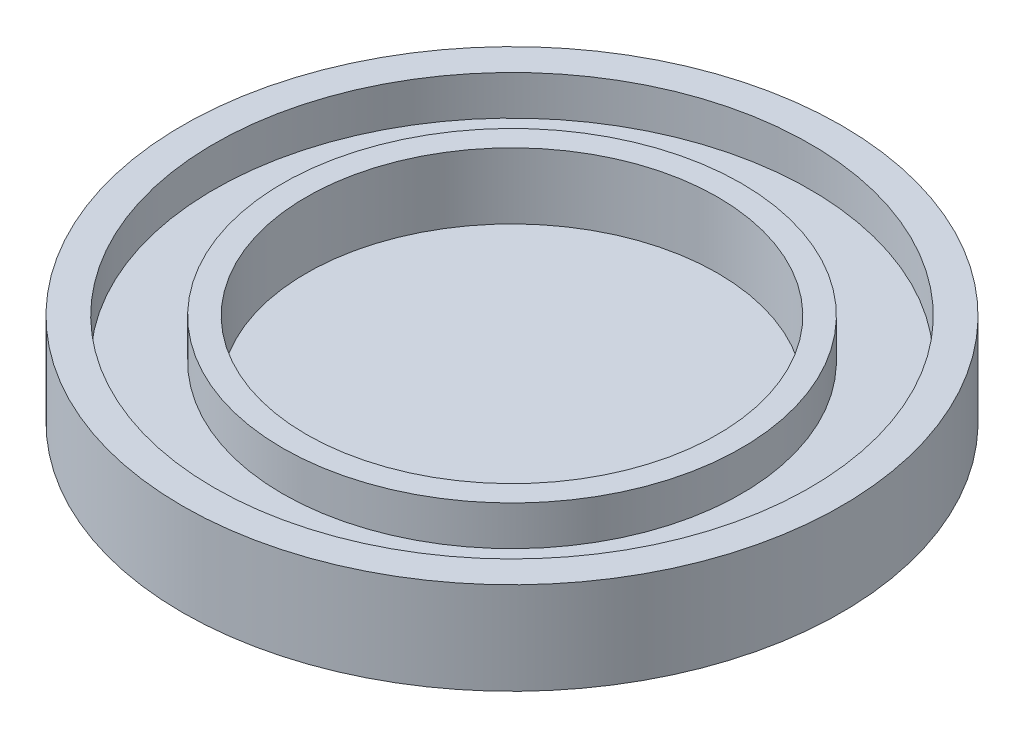
ISO-10303-21;
HEADER;
FILE_DESCRIPTION(('STEP AP214'),'2;1');
FILE_NAME('part.step','',(''),(''),'','','');
FILE_SCHEMA(('AUTOMOTIVE_DESIGN { 1 0 10303 214 1 1 1 1 }'));
ENDSEC;
DATA;
#1=APPLICATION_CONTEXT('core data for automotive mechanical design processes');
#2=APPLICATION_PROTOCOL_DEFINITION('international standard','automotive_design',2000,#1);
#3=PRODUCT_CONTEXT('',#1,'mechanical');
#4=PRODUCT('Part','Part','',(#3));
#5=PRODUCT_RELATED_PRODUCT_CATEGORY('part','',(#4));
#6=PRODUCT_DEFINITION_FORMATION('','',#4);
#7=PRODUCT_DEFINITION_CONTEXT('part definition',#1,'design');
#8=PRODUCT_DEFINITION('design','',#6,#7);
#9=PRODUCT_DEFINITION_SHAPE('','',#8);
#10=(LENGTH_UNIT() NAMED_UNIT(*) SI_UNIT(.MILLI.,.METRE.));
#11=(NAMED_UNIT(*) PLANE_ANGLE_UNIT() SI_UNIT($,.RADIAN.));
#12=(NAMED_UNIT(*) SI_UNIT($,.STERADIAN.) SOLID_ANGLE_UNIT());
#13=UNCERTAINTY_MEASURE_WITH_UNIT(LENGTH_MEASURE(1.E-05),#10,'distance_accuracy_value','');
#14=(GEOMETRIC_REPRESENTATION_CONTEXT(3) GLOBAL_UNCERTAINTY_ASSIGNED_CONTEXT((#13)) GLOBAL_UNIT_ASSIGNED_CONTEXT((#10,
#11,#12)) REPRESENTATION_CONTEXT('',''));
#15=CARTESIAN_POINT('',(0.,0.,0.));
#16=DIRECTION('',(0.,0.,1.));
#17=DIRECTION('',(1.,0.,0.));
#18=AXIS2_PLACEMENT_3D('',#15,#16,#17);
#19=CARTESIAN_POINT('',(0.,7.,0.));
#20=DIRECTION('',(0.,-1.,0.));
#21=DIRECTION('',(0.,0.,-1.));
#22=AXIS2_PLACEMENT_3D('',#19,#20,#21);
#23=CYLINDRICAL_SURFACE('',#22,25.);
#24=CARTESIAN_POINT('',(0.,7.,0.));
#25=DIRECTION('',(0.,1.,0.));
#26=DIRECTION('',(0.,0.,1.));
#27=AXIS2_PLACEMENT_3D('',#24,#25,#26);
#28=CIRCLE('',#27,25.);
#29=CARTESIAN_POINT('',(0.,7.,25.));
#30=VERTEX_POINT('',#29);
#31=EDGE_CURVE('E10',#30,#30,#28,.T.);
#32=ORIENTED_EDGE('',*,*,#31,.F.);
#33=EDGE_LOOP('',(#32));
#34=FACE_BOUND('',#33,.T.);
#35=CARTESIAN_POINT('',(0.,0.,0.));
#36=DIRECTION('',(0.,1.,0.));
#37=DIRECTION('',(0.,0.,1.));
#38=AXIS2_PLACEMENT_3D('',#35,#36,#37);
#39=CIRCLE('',#38,25.);
#40=CARTESIAN_POINT('',(0.,0.,25.));
#41=VERTEX_POINT('',#40);
#42=EDGE_CURVE('E34',#41,#41,#39,.T.);
#43=ORIENTED_EDGE('',*,*,#42,.T.);
#44=EDGE_LOOP('',(#43));
#45=FACE_BOUND('',#44,.T.);
#46=ADVANCED_FACE('F31',(#34,#45),#23,.T.);
#47=CARTESIAN_POINT('',(0.,7.,0.));
#48=DIRECTION('',(0.,1.,0.));
#49=DIRECTION('',(0.,0.,1.));
#50=AXIS2_PLACEMENT_3D('',#47,#48,#49);
#51=PLANE('',#50);
#52=CARTESIAN_POINT('',(0.,7.,0.));
#53=DIRECTION('',(0.,1.,0.));
#54=DIRECTION('',(0.,0.,1.));
#55=AXIS2_PLACEMENT_3D('',#52,#53,#54);
#56=CIRCLE('',#55,22.6);
#57=CARTESIAN_POINT('',(0.,7.,22.6));
#58=VERTEX_POINT('',#57);
#59=EDGE_CURVE('E49',#58,#58,#56,.T.);
#60=ORIENTED_EDGE('',*,*,#59,.F.);
#61=EDGE_LOOP('',(#60));
#62=FACE_BOUND('',#61,.T.);
#63=ORIENTED_EDGE('',*,*,#31,.T.);
#64=EDGE_LOOP('',(#63));
#65=FACE_BOUND('',#64,.T.);
#66=ADVANCED_FACE('F77',(#62,#65),#51,.T.);
#67=CARTESIAN_POINT('',(0.,0.,0.));
#68=DIRECTION('',(0.,1.,0.));
#69=DIRECTION('',(0.,0.,1.));
#70=AXIS2_PLACEMENT_3D('',#67,#68,#69);
#71=PLANE('',#70);
#72=ORIENTED_EDGE('',*,*,#42,.F.);
#73=EDGE_LOOP('',(#72));
#74=FACE_BOUND('',#73,.T.);
#75=ADVANCED_FACE('F73',(#74),#71,.F.);
#76=CARTESIAN_POINT('',(0.,4.,0.));
#77=DIRECTION('',(0.,1.,0.));
#78=DIRECTION('',(0.,0.,1.));
#79=AXIS2_PLACEMENT_3D('',#76,#77,#78);
#80=CYLINDRICAL_SURFACE('',#79,22.6);
#81=CARTESIAN_POINT('',(0.,4.,0.));
#82=DIRECTION('',(0.,1.,0.));
#83=DIRECTION('',(0.,0.,1.));
#84=AXIS2_PLACEMENT_3D('',#81,#82,#83);
#85=CIRCLE('',#84,22.6);
#86=CARTESIAN_POINT('',(0.,4.,22.6));
#87=VERTEX_POINT('',#86);
#88=EDGE_CURVE('E46',#87,#87,#85,.T.);
#89=ORIENTED_EDGE('',*,*,#88,.F.);
#90=EDGE_LOOP('',(#89));
#91=FACE_BOUND('',#90,.T.);
#92=ORIENTED_EDGE('',*,*,#59,.T.);
#93=EDGE_LOOP('',(#92));
#94=FACE_BOUND('',#93,.T.);
#95=ADVANCED_FACE('F67',(#91,#94),#80,.F.);
#96=CARTESIAN_POINT('',(0.,4.,0.));
#97=DIRECTION('',(0.,1.,0.));
#98=DIRECTION('',(0.,0.,1.));
#99=AXIS2_PLACEMENT_3D('',#96,#97,#98);
#100=PLANE('',#99);
#101=CARTESIAN_POINT('',(0.,4.,0.));
#102=DIRECTION('',(0.,1.,0.));
#103=DIRECTION('',(0.,0.,1.));
#104=AXIS2_PLACEMENT_3D('',#101,#102,#103);
#105=CIRCLE('',#104,17.4);
#106=CARTESIAN_POINT('',(0.,4.,17.4));
#107=VERTEX_POINT('',#106);
#108=EDGE_CURVE('E52',#107,#107,#105,.T.);
#109=ORIENTED_EDGE('',*,*,#108,.F.);
#110=EDGE_LOOP('',(#109));
#111=FACE_BOUND('',#110,.T.);
#112=ORIENTED_EDGE('',*,*,#88,.T.);
#113=EDGE_LOOP('',(#112));
#114=FACE_BOUND('',#113,.T.);
#115=ADVANCED_FACE('F64',(#111,#114),#100,.T.);
#116=CARTESIAN_POINT('',(0.,4.,0.));
#117=DIRECTION('',(0.,1.,0.));
#118=DIRECTION('',(0.,0.,1.));
#119=AXIS2_PLACEMENT_3D('',#116,#117,#118);
#120=CYLINDRICAL_SURFACE('',#119,17.4);
#121=ORIENTED_EDGE('',*,*,#108,.T.);
#122=EDGE_LOOP('',(#121));
#123=FACE_BOUND('',#122,.T.);
#124=CARTESIAN_POINT('',(0.,7.,0.));
#125=DIRECTION('',(0.,1.,0.));
#126=DIRECTION('',(0.,0.,1.));
#127=AXIS2_PLACEMENT_3D('',#124,#125,#126);
#128=CIRCLE('',#127,17.4);
#129=CARTESIAN_POINT('',(0.,7.,17.4));
#130=VERTEX_POINT('',#129);
#131=EDGE_CURVE('E55',#130,#130,#128,.T.);
#132=ORIENTED_EDGE('',*,*,#131,.F.);
#133=EDGE_LOOP('',(#132));
#134=FACE_BOUND('',#133,.T.);
#135=ADVANCED_FACE('F61',(#123,#134),#120,.T.);
#136=CARTESIAN_POINT('',(0.,2.,0.));
#137=DIRECTION('',(0.,1.,0.));
#138=DIRECTION('',(0.,0.,1.));
#139=AXIS2_PLACEMENT_3D('',#136,#137,#138);
#140=PLANE('',#139);
#141=CARTESIAN_POINT('',(0.,2.,0.));
#142=DIRECTION('',(0.,1.,0.));
#143=DIRECTION('',(0.,0.,1.));
#144=AXIS2_PLACEMENT_3D('',#141,#142,#143);
#145=CIRCLE('',#144,15.6);
#146=CARTESIAN_POINT('',(0.,2.,15.6));
#147=VERTEX_POINT('',#146);
#148=EDGE_CURVE('E41',#147,#147,#145,.T.);
#149=ORIENTED_EDGE('',*,*,#148,.T.);
#150=EDGE_LOOP('',(#149));
#151=FACE_BOUND('',#150,.T.);
#152=ADVANCED_FACE('F94',(#151),#140,.T.);
#153=CARTESIAN_POINT('',(0.,2.,0.));
#154=DIRECTION('',(0.,1.,0.));
#155=DIRECTION('',(0.,0.,1.));
#156=AXIS2_PLACEMENT_3D('',#153,#154,#155);
#157=CYLINDRICAL_SURFACE('',#156,15.6);
#158=ORIENTED_EDGE('',*,*,#148,.F.);
#159=EDGE_LOOP('',(#158));
#160=FACE_BOUND('',#159,.T.);
#161=CARTESIAN_POINT('',(0.,7.,0.));
#162=DIRECTION('',(0.,1.,0.));
#163=DIRECTION('',(0.,0.,1.));
#164=AXIS2_PLACEMENT_3D('',#161,#162,#163);
#165=CIRCLE('',#164,15.6);
#166=CARTESIAN_POINT('',(0.,7.,15.6));
#167=VERTEX_POINT('',#166);
#168=EDGE_CURVE('E43',#167,#167,#165,.T.);
#169=ORIENTED_EDGE('',*,*,#168,.T.);
#170=EDGE_LOOP('',(#169));
#171=FACE_BOUND('',#170,.T.);
#172=ADVANCED_FACE('F89',(#160,#171),#157,.F.);
#173=ORIENTED_EDGE('',*,*,#168,.F.);
#174=EDGE_LOOP('',(#173));
#175=FACE_BOUND('',#174,.T.);
#176=ORIENTED_EDGE('',*,*,#131,.T.);
#177=EDGE_LOOP('',(#176));
#178=FACE_BOUND('',#177,.T.);
#179=ADVANCED_FACE('F80',(#175,#178),#51,.T.);
#180=CLOSED_SHELL('',(#46,#66,#75,#95,#115,#135,#152,#172,#179));
#181=MANIFOLD_SOLID_BREP('B2',#180);
#182=ADVANCED_BREP_SHAPE_REPRESENTATION('',(#18,#181),#14);
#183=SHAPE_DEFINITION_REPRESENTATION(#9,#182);
ENDSEC;
END-ISO-10303-21;
